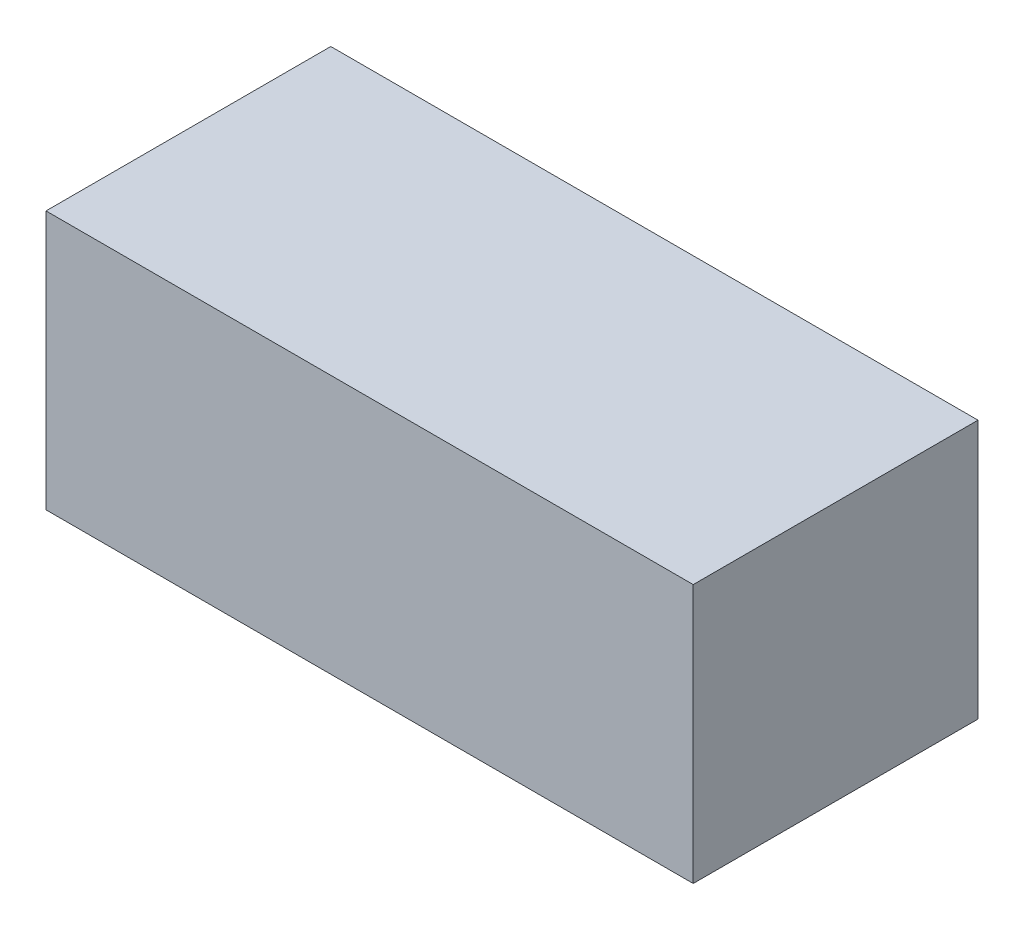
ISO-10303-21;
HEADER;
FILE_DESCRIPTION(('STEP AP214'),'2;1');
FILE_NAME('part.step','',(''),(''),'','','');
FILE_SCHEMA(('AUTOMOTIVE_DESIGN { 1 0 10303 214 1 1 1 1 }'));
ENDSEC;
DATA;
#1=APPLICATION_CONTEXT('core data for automotive mechanical design processes');
#2=APPLICATION_PROTOCOL_DEFINITION('international standard','automotive_design',2000,#1);
#3=PRODUCT_CONTEXT('',#1,'mechanical');
#4=PRODUCT('Part','Part','',(#3));
#5=PRODUCT_RELATED_PRODUCT_CATEGORY('part','',(#4));
#6=PRODUCT_DEFINITION_FORMATION('','',#4);
#7=PRODUCT_DEFINITION_CONTEXT('part definition',#1,'design');
#8=PRODUCT_DEFINITION('design','',#6,#7);
#9=PRODUCT_DEFINITION_SHAPE('','',#8);
#10=(LENGTH_UNIT() NAMED_UNIT(*) SI_UNIT(.MILLI.,.METRE.));
#11=(NAMED_UNIT(*) PLANE_ANGLE_UNIT() SI_UNIT($,.RADIAN.));
#12=(NAMED_UNIT(*) SI_UNIT($,.STERADIAN.) SOLID_ANGLE_UNIT());
#13=UNCERTAINTY_MEASURE_WITH_UNIT(LENGTH_MEASURE(1.E-05),#10,'distance_accuracy_value','');
#14=(GEOMETRIC_REPRESENTATION_CONTEXT(3) GLOBAL_UNCERTAINTY_ASSIGNED_CONTEXT((#13)) GLOBAL_UNIT_ASSIGNED_CONTEXT((#10,
#11,#12)) REPRESENTATION_CONTEXT('',''));
#15=CARTESIAN_POINT('',(0.,0.,0.));
#16=DIRECTION('',(0.,0.,1.));
#17=DIRECTION('',(1.,0.,0.));
#18=AXIS2_PLACEMENT_3D('',#15,#16,#17);
#19=CARTESIAN_POINT('',(0.,200.,0.));
#20=DIRECTION('',(-1.,0.,0.));
#21=DIRECTION('',(0.,0.,1.));
#22=AXIS2_PLACEMENT_3D('',#19,#20,#21);
#23=PLANE('',#22);
#24=DIRECTION('',(0.,0.,-1.));
#25=VECTOR('',#24,1.);
#26=CARTESIAN_POINT('',(0.,0.,0.));
#27=LINE('',#26,#25);
#28=CARTESIAN_POINT('',(0.,0.,0.));
#29=VERTEX_POINT('',#28);
#30=CARTESIAN_POINT('',(0.,0.,-220.));
#31=VERTEX_POINT('',#30);
#32=EDGE_CURVE('E75',#29,#31,#27,.T.);
#33=ORIENTED_EDGE('',*,*,#32,.T.);
#34=DIRECTION('',(0.,-1.,0.));
#35=VECTOR('',#34,1.);
#36=CARTESIAN_POINT('',(0.,200.,-220.));
#37=LINE('',#36,#35);
#38=CARTESIAN_POINT('',(0.,200.,-220.));
#39=VERTEX_POINT('',#38);
#40=EDGE_CURVE('E11',#39,#31,#37,.T.);
#41=ORIENTED_EDGE('',*,*,#40,.F.);
#42=DIRECTION('',(0.,0.,-1.));
#43=VECTOR('',#42,1.);
#44=CARTESIAN_POINT('',(0.,200.,0.));
#45=LINE('',#44,#43);
#46=CARTESIAN_POINT('',(0.,200.,0.));
#47=VERTEX_POINT('',#46);
#48=EDGE_CURVE('E93',#47,#39,#45,.T.);
#49=ORIENTED_EDGE('',*,*,#48,.F.);
#50=DIRECTION('',(0.,-1.,0.));
#51=VECTOR('',#50,1.);
#52=CARTESIAN_POINT('',(0.,200.,0.));
#53=LINE('',#52,#51);
#54=EDGE_CURVE('E87',#47,#29,#53,.T.);
#55=ORIENTED_EDGE('',*,*,#54,.T.);
#56=EDGE_LOOP('',(#33,#41,#49,#55));
#57=FACE_BOUND('',#56,.T.);
#58=ADVANCED_FACE('F31',(#57),#23,.F.);
#59=CARTESIAN_POINT('',(0.,200.,-220.));
#60=DIRECTION('',(0.,0.,1.));
#61=DIRECTION('',(1.,0.,0.));
#62=AXIS2_PLACEMENT_3D('',#59,#60,#61);
#63=PLANE('',#62);
#64=DIRECTION('',(-1.,0.,0.));
#65=VECTOR('',#64,1.);
#66=CARTESIAN_POINT('',(0.,0.,-220.));
#67=LINE('',#66,#65);
#68=CARTESIAN_POINT('',(-500.,0.,-220.));
#69=VERTEX_POINT('',#68);
#70=EDGE_CURVE('E71',#31,#69,#67,.T.);
#71=ORIENTED_EDGE('',*,*,#70,.T.);
#72=DIRECTION('',(0.,-1.,0.));
#73=VECTOR('',#72,1.);
#74=CARTESIAN_POINT('',(-500.,200.,-220.));
#75=LINE('',#74,#73);
#76=CARTESIAN_POINT('',(-500.,200.,-220.));
#77=VERTEX_POINT('',#76);
#78=EDGE_CURVE('E38',#77,#69,#75,.T.);
#79=ORIENTED_EDGE('',*,*,#78,.F.);
#80=DIRECTION('',(-1.,0.,0.));
#81=VECTOR('',#80,1.);
#82=CARTESIAN_POINT('',(0.,200.,-220.));
#83=LINE('',#82,#81);
#84=EDGE_CURVE('E83',#39,#77,#83,.T.);
#85=ORIENTED_EDGE('',*,*,#84,.F.);
#86=ORIENTED_EDGE('',*,*,#40,.T.);
#87=EDGE_LOOP('',(#71,#79,#85,#86));
#88=FACE_BOUND('',#87,.T.);
#89=ADVANCED_FACE('F82',(#88),#63,.F.);
#90=CARTESIAN_POINT('',(-500.,200.,1.22460635382238E-13));
#91=DIRECTION('',(1.,0.,0.));
#92=DIRECTION('',(0.,0.,-1.));
#93=AXIS2_PLACEMENT_3D('',#90,#91,#92);
#94=PLANE('',#93);
#95=DIRECTION('',(0.,0.,1.));
#96=VECTOR('',#95,1.);
#97=CARTESIAN_POINT('',(-500.,0.,1.22460635382238E-13));
#98=LINE('',#97,#96);
#99=CARTESIAN_POINT('',(-500.,0.,1.22460635382238E-13));
#100=VERTEX_POINT('',#99);
#101=EDGE_CURVE('E76',#69,#100,#98,.T.);
#102=ORIENTED_EDGE('',*,*,#101,.T.);
#103=DIRECTION('',(0.,-1.,0.));
#104=VECTOR('',#103,1.);
#105=CARTESIAN_POINT('',(-500.,200.,1.22460635382238E-13));
#106=LINE('',#105,#104);
#107=CARTESIAN_POINT('',(-500.,200.,1.22460635382238E-13));
#108=VERTEX_POINT('',#107);
#109=EDGE_CURVE('E99',#108,#100,#106,.T.);
#110=ORIENTED_EDGE('',*,*,#109,.F.);
#111=DIRECTION('',(0.,0.,1.));
#112=VECTOR('',#111,1.);
#113=CARTESIAN_POINT('',(-500.,200.,1.22460635382238E-13));
#114=LINE('',#113,#112);
#115=EDGE_CURVE('E50',#77,#108,#114,.T.);
#116=ORIENTED_EDGE('',*,*,#115,.F.);
#117=ORIENTED_EDGE('',*,*,#78,.T.);
#118=EDGE_LOOP('',(#102,#110,#116,#117));
#119=FACE_BOUND('',#118,.T.);
#120=ADVANCED_FACE('F102',(#119),#94,.F.);
#121=CARTESIAN_POINT('',(0.,200.,0.));
#122=DIRECTION('',(0.,0.,-1.));
#123=DIRECTION('',(-1.,0.,0.));
#124=AXIS2_PLACEMENT_3D('',#121,#122,#123);
#125=PLANE('',#124);
#126=DIRECTION('',(1.,0.,0.));
#127=VECTOR('',#126,1.);
#128=CARTESIAN_POINT('',(0.,0.,0.));
#129=LINE('',#128,#127);
#130=EDGE_CURVE('E91',#100,#29,#129,.T.);
#131=ORIENTED_EDGE('',*,*,#130,.T.);
#132=ORIENTED_EDGE('',*,*,#54,.F.);
#133=DIRECTION('',(1.,0.,0.));
#134=VECTOR('',#133,1.);
#135=CARTESIAN_POINT('',(0.,200.,0.));
#136=LINE('',#135,#134);
#137=EDGE_CURVE('E45',#108,#47,#136,.T.);
#138=ORIENTED_EDGE('',*,*,#137,.F.);
#139=ORIENTED_EDGE('',*,*,#109,.T.);
#140=EDGE_LOOP('',(#131,#132,#138,#139));
#141=FACE_BOUND('',#140,.T.);
#142=ADVANCED_FACE('F104',(#141),#125,.F.);
#143=CARTESIAN_POINT('',(0.,200.,-220.));
#144=DIRECTION('',(0.,1.,0.));
#145=DIRECTION('',(0.,0.,1.));
#146=AXIS2_PLACEMENT_3D('',#143,#144,#145);
#147=PLANE('',#146);
#148=ORIENTED_EDGE('',*,*,#48,.T.);
#149=ORIENTED_EDGE('',*,*,#84,.T.);
#150=ORIENTED_EDGE('',*,*,#115,.T.);
#151=ORIENTED_EDGE('',*,*,#137,.T.);
#152=EDGE_LOOP('',(#148,#149,#150,#151));
#153=FACE_BOUND('',#152,.T.);
#154=ADVANCED_FACE('F105',(#153),#147,.T.);
#155=CARTESIAN_POINT('',(0.,0.,-220.));
#156=DIRECTION('',(0.,1.,0.));
#157=DIRECTION('',(0.,0.,1.));
#158=AXIS2_PLACEMENT_3D('',#155,#156,#157);
#159=PLANE('',#158);
#160=ORIENTED_EDGE('',*,*,#32,.F.);
#161=ORIENTED_EDGE('',*,*,#130,.F.);
#162=ORIENTED_EDGE('',*,*,#101,.F.);
#163=ORIENTED_EDGE('',*,*,#70,.F.);
#164=EDGE_LOOP('',(#160,#161,#162,#163));
#165=FACE_BOUND('',#164,.T.);
#166=ADVANCED_FACE('F72',(#165),#159,.F.);
#167=CLOSED_SHELL('',(#58,#89,#120,#142,#154,#166));
#168=MANIFOLD_SOLID_BREP('B2',#167);
#169=ADVANCED_BREP_SHAPE_REPRESENTATION('',(#18,#168),#14);
#170=SHAPE_DEFINITION_REPRESENTATION(#9,#169);
ENDSEC;
END-ISO-10303-21;
